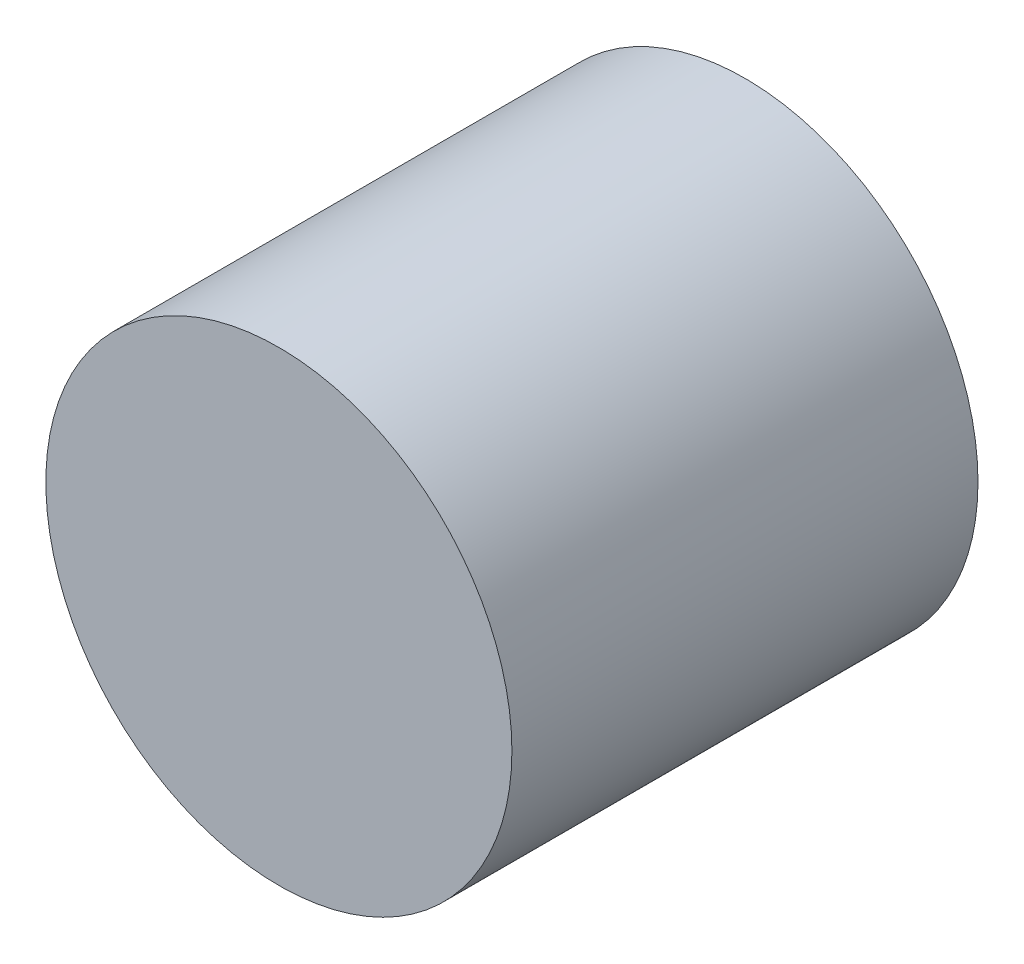
ISO-10303-21;
HEADER;
FILE_DESCRIPTION(('STEP AP214'),'2;1');
FILE_NAME('part.step','',(''),(''),'','','');
FILE_SCHEMA(('AUTOMOTIVE_DESIGN { 1 0 10303 214 1 1 1 1 }'));
ENDSEC;
DATA;
#1=APPLICATION_CONTEXT('core data for automotive mechanical design processes');
#2=APPLICATION_PROTOCOL_DEFINITION('international standard','automotive_design',2000,#1);
#3=PRODUCT_CONTEXT('',#1,'mechanical');
#4=PRODUCT('Part','Part','',(#3));
#5=PRODUCT_RELATED_PRODUCT_CATEGORY('part','',(#4));
#6=PRODUCT_DEFINITION_FORMATION('','',#4);
#7=PRODUCT_DEFINITION_CONTEXT('part definition',#1,'design');
#8=PRODUCT_DEFINITION('design','',#6,#7);
#9=PRODUCT_DEFINITION_SHAPE('','',#8);
#10=(LENGTH_UNIT() NAMED_UNIT(*) SI_UNIT(.MILLI.,.METRE.));
#11=(NAMED_UNIT(*) PLANE_ANGLE_UNIT() SI_UNIT($,.RADIAN.));
#12=(NAMED_UNIT(*) SI_UNIT($,.STERADIAN.) SOLID_ANGLE_UNIT());
#13=UNCERTAINTY_MEASURE_WITH_UNIT(LENGTH_MEASURE(1.E-05),#10,'distance_accuracy_value','');
#14=(GEOMETRIC_REPRESENTATION_CONTEXT(3) GLOBAL_UNCERTAINTY_ASSIGNED_CONTEXT((#13)) GLOBAL_UNIT_ASSIGNED_CONTEXT((#10,
#11,#12)) REPRESENTATION_CONTEXT('',''));
#15=CARTESIAN_POINT('',(0.,0.,0.));
#16=DIRECTION('',(0.,0.,1.));
#17=DIRECTION('',(1.,0.,0.));
#18=AXIS2_PLACEMENT_3D('',#15,#16,#17);
#19=CARTESIAN_POINT('',(0.,0.,5.));
#20=DIRECTION('',(0.,0.,-1.));
#21=DIRECTION('',(-1.,0.,0.));
#22=AXIS2_PLACEMENT_3D('',#19,#20,#21);
#23=CYLINDRICAL_SURFACE('',#22,2.5);
#24=CARTESIAN_POINT('',(0.,0.,5.));
#25=DIRECTION('',(0.,0.,1.));
#26=DIRECTION('',(1.,0.,0.));
#27=AXIS2_PLACEMENT_3D('',#24,#25,#26);
#28=CIRCLE('',#27,2.5);
#29=CARTESIAN_POINT('',(2.5,0.,5.));
#30=VERTEX_POINT('',#29);
#31=EDGE_CURVE('E10',#30,#30,#28,.T.);
#32=ORIENTED_EDGE('',*,*,#31,.F.);
#33=EDGE_LOOP('',(#32));
#34=FACE_BOUND('',#33,.T.);
#35=CARTESIAN_POINT('',(0.,0.,0.));
#36=DIRECTION('',(0.,0.,1.));
#37=DIRECTION('',(1.,0.,0.));
#38=AXIS2_PLACEMENT_3D('',#35,#36,#37);
#39=CIRCLE('',#38,2.5);
#40=CARTESIAN_POINT('',(2.5,0.,0.));
#41=VERTEX_POINT('',#40);
#42=EDGE_CURVE('E35',#41,#41,#39,.T.);
#43=ORIENTED_EDGE('',*,*,#42,.T.);
#44=EDGE_LOOP('',(#43));
#45=FACE_BOUND('',#44,.T.);
#46=ADVANCED_FACE('F32',(#34,#45),#23,.T.);
#47=CARTESIAN_POINT('',(0.,0.,5.));
#48=DIRECTION('',(0.,0.,1.));
#49=DIRECTION('',(1.,0.,0.));
#50=AXIS2_PLACEMENT_3D('',#47,#48,#49);
#51=PLANE('',#50);
#52=ORIENTED_EDGE('',*,*,#31,.T.);
#53=EDGE_LOOP('',(#52));
#54=FACE_BOUND('',#53,.T.);
#55=ADVANCED_FACE('F47',(#54),#51,.T.);
#56=CARTESIAN_POINT('',(0.,0.,0.));
#57=DIRECTION('',(0.,0.,1.));
#58=DIRECTION('',(1.,0.,0.));
#59=AXIS2_PLACEMENT_3D('',#56,#57,#58);
#60=PLANE('',#59);
#61=ORIENTED_EDGE('',*,*,#42,.F.);
#62=EDGE_LOOP('',(#61));
#63=FACE_BOUND('',#62,.T.);
#64=ADVANCED_FACE('F45',(#63),#60,.F.);
#65=CLOSED_SHELL('',(#46,#55,#64));
#66=MANIFOLD_SOLID_BREP('B2',#65);
#67=ADVANCED_BREP_SHAPE_REPRESENTATION('',(#18,#66),#14);
#68=SHAPE_DEFINITION_REPRESENTATION(#9,#67);
ENDSEC;
END-ISO-10303-21;
